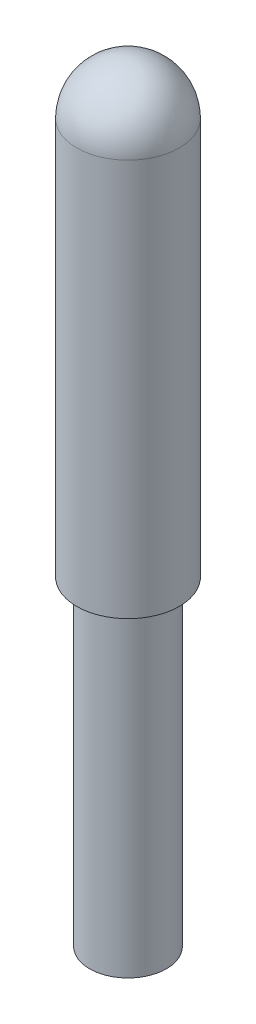
ISO-10303-21;
HEADER;
FILE_DESCRIPTION(('STEP AP214'),'2;1');
FILE_NAME('part.step','',(''),(''),'','','');
FILE_SCHEMA(('AUTOMOTIVE_DESIGN { 1 0 10303 214 1 1 1 1 }'));
ENDSEC;
DATA;
#1=APPLICATION_CONTEXT('core data for automotive mechanical design processes');
#2=APPLICATION_PROTOCOL_DEFINITION('international standard','automotive_design',2000,#1);
#3=PRODUCT_CONTEXT('',#1,'mechanical');
#4=PRODUCT('Part','Part','',(#3));
#5=PRODUCT_RELATED_PRODUCT_CATEGORY('part','',(#4));
#6=PRODUCT_DEFINITION_FORMATION('','',#4);
#7=PRODUCT_DEFINITION_CONTEXT('part definition',#1,'design');
#8=PRODUCT_DEFINITION('design','',#6,#7);
#9=PRODUCT_DEFINITION_SHAPE('','',#8);
#10=(LENGTH_UNIT() NAMED_UNIT(*) SI_UNIT(.MILLI.,.METRE.));
#11=(NAMED_UNIT(*) PLANE_ANGLE_UNIT() SI_UNIT($,.RADIAN.));
#12=(NAMED_UNIT(*) SI_UNIT($,.STERADIAN.) SOLID_ANGLE_UNIT());
#13=UNCERTAINTY_MEASURE_WITH_UNIT(LENGTH_MEASURE(1.E-05),#10,'distance_accuracy_value','');
#14=(GEOMETRIC_REPRESENTATION_CONTEXT(3) GLOBAL_UNCERTAINTY_ASSIGNED_CONTEXT((#13)) GLOBAL_UNIT_ASSIGNED_CONTEXT((#10,
#11,#12)) REPRESENTATION_CONTEXT('',''));
#15=CARTESIAN_POINT('',(0.,0.,0.));
#16=DIRECTION('',(0.,0.,1.));
#17=DIRECTION('',(1.,0.,0.));
#18=AXIS2_PLACEMENT_3D('',#15,#16,#17);
#19=CARTESIAN_POINT('',(0.,35.,0.));
#20=DIRECTION('',(0.,-1.,0.));
#21=DIRECTION('',(0.,0.,-1.));
#22=AXIS2_PLACEMENT_3D('',#19,#20,#21);
#23=CYLINDRICAL_SURFACE('',#22,4.);
#24=CARTESIAN_POINT('',(0.,31.,0.));
#25=DIRECTION('',(0.,-1.,0.));
#26=DIRECTION('',(0.,0.,-1.));
#27=AXIS2_PLACEMENT_3D('',#24,#25,#26);
#28=CIRCLE('',#27,4.);
#29=CARTESIAN_POINT('',(0.,31.,-4.));
#30=VERTEX_POINT('',#29);
#31=EDGE_CURVE('E11',#30,#30,#28,.T.);
#32=ORIENTED_EDGE('',*,*,#31,.T.);
#33=EDGE_LOOP('',(#32));
#34=FACE_BOUND('',#33,.T.);
#35=CARTESIAN_POINT('',(0.,0.,0.));
#36=DIRECTION('',(0.,1.,0.));
#37=DIRECTION('',(0.,0.,1.));
#38=AXIS2_PLACEMENT_3D('',#35,#36,#37);
#39=CIRCLE('',#38,4.);
#40=CARTESIAN_POINT('',(0.,0.,4.));
#41=VERTEX_POINT('',#40);
#42=EDGE_CURVE('E64',#41,#41,#39,.T.);
#43=ORIENTED_EDGE('',*,*,#42,.T.);
#44=EDGE_LOOP('',(#43));
#45=FACE_BOUND('',#44,.T.);
#46=ADVANCED_FACE('F57',(#34,#45),#23,.T.);
#47=CARTESIAN_POINT('',(0.,0.,0.));
#48=DIRECTION('',(0.,1.,0.));
#49=DIRECTION('',(0.,0.,1.));
#50=AXIS2_PLACEMENT_3D('',#47,#48,#49);
#51=PLANE('',#50);
#52=CARTESIAN_POINT('',(0.,0.,0.));
#53=DIRECTION('',(0.,1.,0.));
#54=DIRECTION('',(0.,0.,1.));
#55=AXIS2_PLACEMENT_3D('',#52,#53,#54);
#56=CIRCLE('',#55,3.);
#57=CARTESIAN_POINT('',(0.,0.,3.));
#58=VERTEX_POINT('',#57);
#59=EDGE_CURVE('E72',#58,#58,#56,.T.);
#60=ORIENTED_EDGE('',*,*,#59,.T.);
#61=EDGE_LOOP('',(#60));
#62=FACE_BOUND('',#61,.T.);
#63=ORIENTED_EDGE('',*,*,#42,.F.);
#64=EDGE_LOOP('',(#63));
#65=FACE_BOUND('',#64,.T.);
#66=ADVANCED_FACE('F78',(#62,#65),#51,.F.);
#67=CARTESIAN_POINT('',(0.,-25.,0.));
#68=DIRECTION('',(0.,1.,0.));
#69=DIRECTION('',(0.,0.,1.));
#70=AXIS2_PLACEMENT_3D('',#67,#68,#69);
#71=CYLINDRICAL_SURFACE('',#70,3.);
#72=CARTESIAN_POINT('',(0.,-25.,0.));
#73=DIRECTION('',(0.,1.,0.));
#74=DIRECTION('',(0.,0.,1.));
#75=AXIS2_PLACEMENT_3D('',#72,#73,#74);
#76=CIRCLE('',#75,3.);
#77=CARTESIAN_POINT('',(0.,-25.,3.));
#78=VERTEX_POINT('',#77);
#79=EDGE_CURVE('E68',#78,#78,#76,.T.);
#80=ORIENTED_EDGE('',*,*,#79,.T.);
#81=EDGE_LOOP('',(#80));
#82=FACE_BOUND('',#81,.T.);
#83=ORIENTED_EDGE('',*,*,#59,.F.);
#84=EDGE_LOOP('',(#83));
#85=FACE_BOUND('',#84,.T.);
#86=ADVANCED_FACE('F81',(#82,#85),#71,.T.);
#87=CARTESIAN_POINT('',(0.,-25.,0.));
#88=DIRECTION('',(0.,1.,0.));
#89=DIRECTION('',(0.,0.,1.));
#90=AXIS2_PLACEMENT_3D('',#87,#88,#89);
#91=PLANE('',#90);
#92=ORIENTED_EDGE('',*,*,#79,.F.);
#93=EDGE_LOOP('',(#92));
#94=FACE_BOUND('',#93,.T.);
#95=ADVANCED_FACE('F83',(#94),#91,.F.);
#96=CARTESIAN_POINT('',(0.,31.,0.));
#97=DIRECTION('',(0.,1.,0.));
#98=DIRECTION('',(0.,0.,1.));
#99=AXIS2_PLACEMENT_3D('',#96,#97,#98);
#100=SPHERICAL_SURFACE('',#99,4.);
#101=ORIENTED_EDGE('',*,*,#31,.F.);
#102=EDGE_LOOP('',(#101));
#103=FACE_BOUND('',#102,.T.);
#104=ADVANCED_FACE('F59',(#103),#100,.T.);
#105=CLOSED_SHELL('',(#46,#66,#86,#95,#104));
#106=MANIFOLD_SOLID_BREP('B2',#105);
#107=ADVANCED_BREP_SHAPE_REPRESENTATION('',(#18,#106),#14);
#108=SHAPE_DEFINITION_REPRESENTATION(#9,#107);
ENDSEC;
END-ISO-10303-21;
